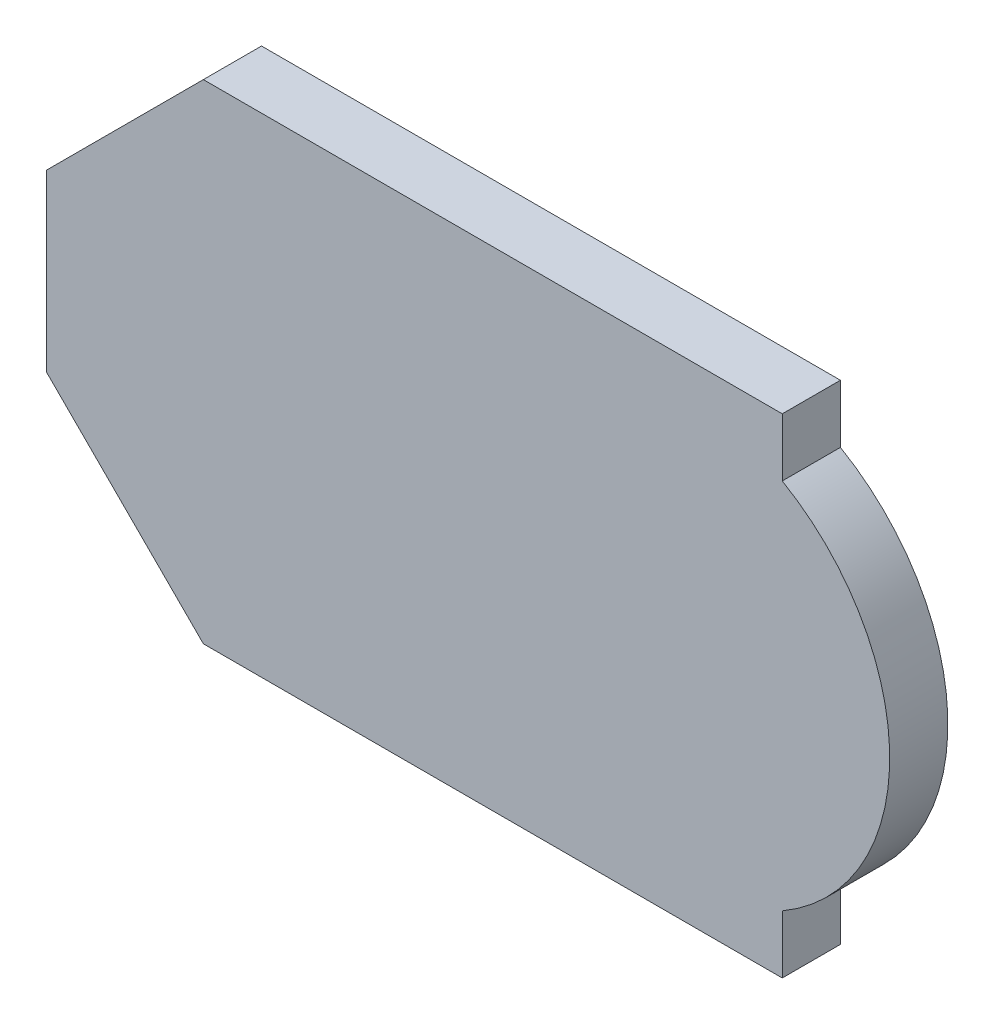
ISO-10303-21;
HEADER;
FILE_DESCRIPTION(('STEP AP214'),'2;1');
FILE_NAME('part.step','',(''),(''),'','','');
FILE_SCHEMA(('AUTOMOTIVE_DESIGN { 1 0 10303 214 1 1 1 1 }'));
ENDSEC;
DATA;
#1=APPLICATION_CONTEXT('core data for automotive mechanical design processes');
#2=APPLICATION_PROTOCOL_DEFINITION('international standard','automotive_design',2000,#1);
#3=PRODUCT_CONTEXT('',#1,'mechanical');
#4=PRODUCT('Part','Part','',(#3));
#5=PRODUCT_RELATED_PRODUCT_CATEGORY('part','',(#4));
#6=PRODUCT_DEFINITION_FORMATION('','',#4);
#7=PRODUCT_DEFINITION_CONTEXT('part definition',#1,'design');
#8=PRODUCT_DEFINITION('design','',#6,#7);
#9=PRODUCT_DEFINITION_SHAPE('','',#8);
#10=(LENGTH_UNIT() NAMED_UNIT(*) SI_UNIT(.MILLI.,.METRE.));
#11=(NAMED_UNIT(*) PLANE_ANGLE_UNIT() SI_UNIT($,.RADIAN.));
#12=(NAMED_UNIT(*) SI_UNIT($,.STERADIAN.) SOLID_ANGLE_UNIT());
#13=UNCERTAINTY_MEASURE_WITH_UNIT(LENGTH_MEASURE(1.E-05),#10,'distance_accuracy_value','');
#14=(GEOMETRIC_REPRESENTATION_CONTEXT(3) GLOBAL_UNCERTAINTY_ASSIGNED_CONTEXT((#13)) GLOBAL_UNIT_ASSIGNED_CONTEXT((#10,
#11,#12)) REPRESENTATION_CONTEXT('',''));
#15=CARTESIAN_POINT('',(0.,0.,0.));
#16=DIRECTION('',(0.,0.,1.));
#17=DIRECTION('',(1.,0.,0.));
#18=AXIS2_PLACEMENT_3D('',#15,#16,#17);
#19=CARTESIAN_POINT('',(20.5247914026375,-2.1629531499201E-08,-4.99999999999989));
#20=DIRECTION('',(0.,0.,1.));
#21=DIRECTION('',(1.,0.,0.));
#22=AXIS2_PLACEMENT_3D('',#19,#20,#21);
#23=CYLINDRICAL_SURFACE('',#22,18.4752086265619);
#24=CARTESIAN_POINT('',(20.5247914026375,-2.16295592547766E-08,1.11022302462516E-13));
#25=DIRECTION('',(0.,0.,1.));
#26=DIRECTION('',(1.,0.,0.));
#27=AXIS2_PLACEMENT_3D('',#24,#25,#26);
#28=CIRCLE('',#27,18.4752086265619);
#29=CARTESIAN_POINT('',(29.7623956597069,-16.0000000432738,0.));
#30=VERTEX_POINT('',#29);
#31=CARTESIAN_POINT('',(29.7623956597069,16.0000000432739,2.22044604925031E-13));
#32=VERTEX_POINT('',#31);
#33=EDGE_CURVE('E132',#30,#32,#28,.T.);
#34=ORIENTED_EDGE('',*,*,#33,.F.);
#35=DIRECTION('',(0.,0.,1.));
#36=VECTOR('',#35,1.);
#37=CARTESIAN_POINT('',(29.7623956597069,-16.0000000432737,-5.));
#38=LINE('',#37,#36);
#39=CARTESIAN_POINT('',(29.7623956597069,-16.0000000432737,-5.));
#40=VERTEX_POINT('',#39);
#41=EDGE_CURVE('E11',#40,#30,#38,.T.);
#42=ORIENTED_EDGE('',*,*,#41,.F.);
#43=CARTESIAN_POINT('',(20.5247914026375,-2.1629531499201E-08,-4.99999999999989));
#44=DIRECTION('',(0.,0.,1.));
#45=DIRECTION('',(1.,0.,0.));
#46=AXIS2_PLACEMENT_3D('',#43,#44,#45);
#47=CIRCLE('',#46,18.4752086265619);
#48=CARTESIAN_POINT('',(29.7623956597069,16.0000000432739,-4.99999999999978));
#49=VERTEX_POINT('',#48);
#50=EDGE_CURVE('E152',#40,#49,#47,.T.);
#51=ORIENTED_EDGE('',*,*,#50,.T.);
#52=DIRECTION('',(0.,0.,1.));
#53=VECTOR('',#52,1.);
#54=CARTESIAN_POINT('',(29.7623956597069,16.0000000432739,-4.99999999999978));
#55=LINE('',#54,#53);
#56=EDGE_CURVE('E38',#49,#32,#55,.T.);
#57=ORIENTED_EDGE('',*,*,#56,.T.);
#58=EDGE_LOOP('',(#34,#42,#51,#57));
#59=FACE_BOUND('',#58,.T.);
#60=ADVANCED_FACE('F35',(#59),#23,.T.);
#61=CARTESIAN_POINT('',(29.7623956597069,-16.0000000432737,-5.));
#62=DIRECTION('',(1.,0.,0.));
#63=DIRECTION('',(0.,0.,-1.));
#64=AXIS2_PLACEMENT_3D('',#61,#62,#63);
#65=PLANE('',#64);
#66=DIRECTION('',(0.,1.,0.));
#67=VECTOR('',#66,1.);
#68=CARTESIAN_POINT('',(29.7623956597069,-16.0000000432738,0.));
#69=LINE('',#68,#67);
#70=CARTESIAN_POINT('',(29.762395659707,-21.0000000432738,1.11022302462516E-13));
#71=VERTEX_POINT('',#70);
#72=EDGE_CURVE('E150',#71,#30,#69,.T.);
#73=ORIENTED_EDGE('',*,*,#72,.F.);
#74=DIRECTION('',(0.,0.,1.));
#75=VECTOR('',#74,1.);
#76=CARTESIAN_POINT('',(29.762395659707,-21.0000000432738,-4.99999999999989));
#77=LINE('',#76,#75);
#78=CARTESIAN_POINT('',(29.762395659707,-21.0000000432738,-4.99999999999989));
#79=VERTEX_POINT('',#78);
#80=EDGE_CURVE('E44',#79,#71,#77,.T.);
#81=ORIENTED_EDGE('',*,*,#80,.F.);
#82=DIRECTION('',(0.,1.,0.));
#83=VECTOR('',#82,1.);
#84=CARTESIAN_POINT('',(29.7623956597069,-16.0000000432737,-5.));
#85=LINE('',#84,#83);
#86=EDGE_CURVE('E122',#79,#40,#85,.T.);
#87=ORIENTED_EDGE('',*,*,#86,.T.);
#88=ORIENTED_EDGE('',*,*,#41,.T.);
#89=EDGE_LOOP('',(#73,#81,#87,#88));
#90=FACE_BOUND('',#89,.T.);
#91=ADVANCED_FACE('F164',(#90),#65,.T.);
#92=CARTESIAN_POINT('',(29.762395659707,-21.0000000432738,-4.99999999999989));
#93=DIRECTION('',(0.,-1.,0.));
#94=DIRECTION('',(0.,0.,-1.));
#95=AXIS2_PLACEMENT_3D('',#92,#93,#94);
#96=PLANE('',#95);
#97=DIRECTION('',(1.,0.,0.));
#98=VECTOR('',#97,1.);
#99=CARTESIAN_POINT('',(29.762395659707,-21.0000000432738,1.11022302462516E-13));
#100=LINE('',#99,#98);
#101=CARTESIAN_POINT('',(-20.0000000000001,-21.0000000432738,0.));
#102=VERTEX_POINT('',#101);
#103=EDGE_CURVE('E109',#102,#71,#100,.T.);
#104=ORIENTED_EDGE('',*,*,#103,.F.);
#105=DIRECTION('',(0.,0.,1.));
#106=VECTOR('',#105,1.);
#107=CARTESIAN_POINT('',(-20.0000000000001,-21.0000000432737,-5.));
#108=LINE('',#107,#106);
#109=CARTESIAN_POINT('',(-20.0000000000001,-21.0000000432737,-5.));
#110=VERTEX_POINT('',#109);
#111=EDGE_CURVE('E104',#110,#102,#108,.T.);
#112=ORIENTED_EDGE('',*,*,#111,.F.);
#113=DIRECTION('',(1.,0.,0.));
#114=VECTOR('',#113,1.);
#115=CARTESIAN_POINT('',(29.762395659707,-21.0000000432738,-4.99999999999989));
#116=LINE('',#115,#114);
#117=EDGE_CURVE('E107',#110,#79,#116,.T.);
#118=ORIENTED_EDGE('',*,*,#117,.T.);
#119=ORIENTED_EDGE('',*,*,#80,.T.);
#120=EDGE_LOOP('',(#104,#112,#118,#119));
#121=FACE_BOUND('',#120,.T.);
#122=ADVANCED_FACE('F106',(#121),#96,.T.);
#123=CARTESIAN_POINT('',(-33.5000000432739,-7.49999999999992,-5.));
#124=DIRECTION('',(-0.707106781186546,-0.70710678118655,0.));
#125=DIRECTION('',(0.70710678118655,-0.707106781186546,0.));
#126=AXIS2_PLACEMENT_3D('',#123,#124,#125);
#127=PLANE('',#126);
#128=DIRECTION('',(0.70710678118655,-0.707106781186546,0.));
#129=VECTOR('',#128,1.);
#130=CARTESIAN_POINT('',(-33.500000043274,-7.49999999999995,0.));
#131=LINE('',#130,#129);
#132=CARTESIAN_POINT('',(-33.500000043274,-7.49999999999995,0.));
#133=VERTEX_POINT('',#132);
#134=EDGE_CURVE('E147',#133,#102,#131,.T.);
#135=ORIENTED_EDGE('',*,*,#134,.F.);
#136=DIRECTION('',(0.,0.,1.));
#137=VECTOR('',#136,1.);
#138=CARTESIAN_POINT('',(-33.5000000432739,-7.49999999999992,-5.));
#139=LINE('',#138,#137);
#140=CARTESIAN_POINT('',(-33.5000000432739,-7.49999999999992,-5.));
#141=VERTEX_POINT('',#140);
#142=EDGE_CURVE('E114',#141,#133,#139,.T.);
#143=ORIENTED_EDGE('',*,*,#142,.F.);
#144=DIRECTION('',(0.70710678118655,-0.707106781186546,0.));
#145=VECTOR('',#144,1.);
#146=CARTESIAN_POINT('',(-33.5000000432739,-7.49999999999992,-5.));
#147=LINE('',#146,#145);
#148=EDGE_CURVE('E120',#141,#110,#147,.T.);
#149=ORIENTED_EDGE('',*,*,#148,.T.);
#150=ORIENTED_EDGE('',*,*,#111,.T.);
#151=EDGE_LOOP('',(#135,#143,#149,#150));
#152=FACE_BOUND('',#151,.T.);
#153=ADVANCED_FACE('F124',(#152),#127,.T.);
#154=CARTESIAN_POINT('',(-33.5000000432739,7.50000000000002,-4.99999999999989));
#155=DIRECTION('',(-1.,0.,0.));
#156=DIRECTION('',(0.,-1.,0.));
#157=AXIS2_PLACEMENT_3D('',#154,#155,#156);
#158=PLANE('',#157);
#159=DIRECTION('',(0.,-1.,0.));
#160=VECTOR('',#159,1.);
#161=CARTESIAN_POINT('',(-33.500000043274,7.50000000000008,1.11022302462516E-13));
#162=LINE('',#161,#160);
#163=CARTESIAN_POINT('',(-33.500000043274,7.50000000000008,1.11022302462516E-13));
#164=VERTEX_POINT('',#163);
#165=EDGE_CURVE('E144',#164,#133,#162,.T.);
#166=ORIENTED_EDGE('',*,*,#165,.F.);
#167=DIRECTION('',(0.,0.,1.));
#168=VECTOR('',#167,1.);
#169=CARTESIAN_POINT('',(-33.5000000432739,7.50000000000002,-4.99999999999989));
#170=LINE('',#169,#168);
#171=CARTESIAN_POINT('',(-33.5000000432739,7.50000000000002,-4.99999999999989));
#172=VERTEX_POINT('',#171);
#173=EDGE_CURVE('E156',#172,#164,#170,.T.);
#174=ORIENTED_EDGE('',*,*,#173,.F.);
#175=DIRECTION('',(0.,-1.,0.));
#176=VECTOR('',#175,1.);
#177=CARTESIAN_POINT('',(-33.5000000432739,7.50000000000002,-4.99999999999989));
#178=LINE('',#177,#176);
#179=EDGE_CURVE('E125',#172,#141,#178,.T.);
#180=ORIENTED_EDGE('',*,*,#179,.T.);
#181=ORIENTED_EDGE('',*,*,#142,.T.);
#182=EDGE_LOOP('',(#166,#174,#180,#181));
#183=FACE_BOUND('',#182,.T.);
#184=ADVANCED_FACE('F177',(#183),#158,.T.);
#185=CARTESIAN_POINT('',(-33.5000000432739,7.50000000000002,-4.99999999999989));
#186=DIRECTION('',(-0.707106781186546,0.707106781186551,0.));
#187=DIRECTION('',(-0.707106781186551,-0.707106781186546,0.));
#188=AXIS2_PLACEMENT_3D('',#185,#186,#187);
#189=PLANE('',#188);
#190=DIRECTION('',(-0.707106781186551,-0.707106781186546,0.));
#191=VECTOR('',#190,1.);
#192=CARTESIAN_POINT('',(-33.500000043274,7.50000000000008,1.11022302462516E-13));
#193=LINE('',#192,#191);
#194=CARTESIAN_POINT('',(-20.0000000000001,21.0000000432739,0.));
#195=VERTEX_POINT('',#194);
#196=EDGE_CURVE('E141',#195,#164,#193,.T.);
#197=ORIENTED_EDGE('',*,*,#196,.F.);
#198=DIRECTION('',(0.,0.,1.));
#199=VECTOR('',#198,1.);
#200=CARTESIAN_POINT('',(-20.,21.0000000432739,-5.));
#201=LINE('',#200,#199);
#202=CARTESIAN_POINT('',(-20.,21.0000000432739,-5.));
#203=VERTEX_POINT('',#202);
#204=EDGE_CURVE('E158',#203,#195,#201,.T.);
#205=ORIENTED_EDGE('',*,*,#204,.F.);
#206=DIRECTION('',(-0.707106781186551,-0.707106781186546,0.));
#207=VECTOR('',#206,1.);
#208=CARTESIAN_POINT('',(-33.5000000432739,7.50000000000002,-4.99999999999989));
#209=LINE('',#208,#207);
#210=EDGE_CURVE('E127',#203,#172,#209,.T.);
#211=ORIENTED_EDGE('',*,*,#210,.T.);
#212=ORIENTED_EDGE('',*,*,#173,.T.);
#213=EDGE_LOOP('',(#197,#205,#211,#212));
#214=FACE_BOUND('',#213,.T.);
#215=ADVANCED_FACE('F180',(#214),#189,.T.);
#216=CARTESIAN_POINT('',(29.7623956597069,21.0000000432739,-4.99999999999978));
#217=DIRECTION('',(0.,1.,0.));
#218=DIRECTION('',(0.,0.,1.));
#219=AXIS2_PLACEMENT_3D('',#216,#217,#218);
#220=PLANE('',#219);
#221=DIRECTION('',(-1.,0.,0.));
#222=VECTOR('',#221,1.);
#223=CARTESIAN_POINT('',(29.7623956597069,21.0000000432739,2.22044604925031E-13));
#224=LINE('',#223,#222);
#225=CARTESIAN_POINT('',(29.7623956597069,21.0000000432739,2.22044604925031E-13));
#226=VERTEX_POINT('',#225);
#227=EDGE_CURVE('E138',#226,#195,#224,.T.);
#228=ORIENTED_EDGE('',*,*,#227,.F.);
#229=DIRECTION('',(0.,0.,1.));
#230=VECTOR('',#229,1.);
#231=CARTESIAN_POINT('',(29.7623956597069,21.0000000432739,-4.99999999999978));
#232=LINE('',#231,#230);
#233=CARTESIAN_POINT('',(29.7623956597069,21.0000000432739,-4.99999999999978));
#234=VERTEX_POINT('',#233);
#235=EDGE_CURVE('E159',#234,#226,#232,.T.);
#236=ORIENTED_EDGE('',*,*,#235,.F.);
#237=DIRECTION('',(-1.,0.,0.));
#238=VECTOR('',#237,1.);
#239=CARTESIAN_POINT('',(29.7623956597069,21.0000000432739,-4.99999999999978));
#240=LINE('',#239,#238);
#241=EDGE_CURVE('E255',#234,#203,#240,.T.);
#242=ORIENTED_EDGE('',*,*,#241,.T.);
#243=ORIENTED_EDGE('',*,*,#204,.T.);
#244=EDGE_LOOP('',(#228,#236,#242,#243));
#245=FACE_BOUND('',#244,.T.);
#246=ADVANCED_FACE('F184',(#245),#220,.T.);
#247=CARTESIAN_POINT('',(29.7623956597069,16.0000000432739,-4.99999999999978));
#248=DIRECTION('',(1.,0.,0.));
#249=DIRECTION('',(0.,0.,-1.));
#250=AXIS2_PLACEMENT_3D('',#247,#248,#249);
#251=PLANE('',#250);
#252=DIRECTION('',(0.,1.,0.));
#253=VECTOR('',#252,1.);
#254=CARTESIAN_POINT('',(29.7623956597069,16.0000000432739,2.22044604925031E-13));
#255=LINE('',#254,#253);
#256=EDGE_CURVE('E135',#32,#226,#255,.T.);
#257=ORIENTED_EDGE('',*,*,#256,.F.);
#258=ORIENTED_EDGE('',*,*,#56,.F.);
#259=DIRECTION('',(0.,1.,0.));
#260=VECTOR('',#259,1.);
#261=CARTESIAN_POINT('',(29.7623956597069,16.0000000432739,-4.99999999999978));
#262=LINE('',#261,#260);
#263=EDGE_CURVE('E256',#49,#234,#262,.T.);
#264=ORIENTED_EDGE('',*,*,#263,.T.);
#265=ORIENTED_EDGE('',*,*,#235,.T.);
#266=EDGE_LOOP('',(#257,#258,#264,#265));
#267=FACE_BOUND('',#266,.T.);
#268=ADVANCED_FACE('F161',(#267),#251,.T.);
#269=CARTESIAN_POINT('',(20.5247914026375,-2.1629531499201E-08,-4.99999999999989));
#270=DIRECTION('',(0.,0.,1.));
#271=DIRECTION('',(1.,0.,0.));
#272=AXIS2_PLACEMENT_3D('',#269,#270,#271);
#273=PLANE('',#272);
#274=ORIENTED_EDGE('',*,*,#50,.F.);
#275=ORIENTED_EDGE('',*,*,#86,.F.);
#276=ORIENTED_EDGE('',*,*,#117,.F.);
#277=ORIENTED_EDGE('',*,*,#148,.F.);
#278=ORIENTED_EDGE('',*,*,#179,.F.);
#279=ORIENTED_EDGE('',*,*,#210,.F.);
#280=ORIENTED_EDGE('',*,*,#241,.F.);
#281=ORIENTED_EDGE('',*,*,#263,.F.);
#282=EDGE_LOOP('',(#274,#275,#276,#277,#278,#279,#280,#281));
#283=FACE_BOUND('',#282,.T.);
#284=ADVANCED_FACE('F118',(#283),#273,.F.);
#285=CARTESIAN_POINT('',(20.5247914026375,-2.16295592547766E-08,1.11022302462516E-13));
#286=DIRECTION('',(0.,0.,1.));
#287=DIRECTION('',(1.,0.,0.));
#288=AXIS2_PLACEMENT_3D('',#285,#286,#287);
#289=PLANE('',#288);
#290=ORIENTED_EDGE('',*,*,#33,.T.);
#291=ORIENTED_EDGE('',*,*,#256,.T.);
#292=ORIENTED_EDGE('',*,*,#227,.T.);
#293=ORIENTED_EDGE('',*,*,#196,.T.);
#294=ORIENTED_EDGE('',*,*,#165,.T.);
#295=ORIENTED_EDGE('',*,*,#134,.T.);
#296=ORIENTED_EDGE('',*,*,#103,.T.);
#297=ORIENTED_EDGE('',*,*,#72,.T.);
#298=EDGE_LOOP('',(#290,#291,#292,#293,#294,#295,#296,#297));
#299=FACE_BOUND('',#298,.T.);
#300=ADVANCED_FACE('F163',(#299),#289,.T.);
#301=CLOSED_SHELL('',(#60,#91,#122,#153,#184,#215,#246,#268,#284,#300));
#302=MANIFOLD_SOLID_BREP('B2',#301);
#303=ADVANCED_BREP_SHAPE_REPRESENTATION('',(#18,#302),#14);
#304=SHAPE_DEFINITION_REPRESENTATION(#9,#303);
ENDSEC;
END-ISO-10303-21;
